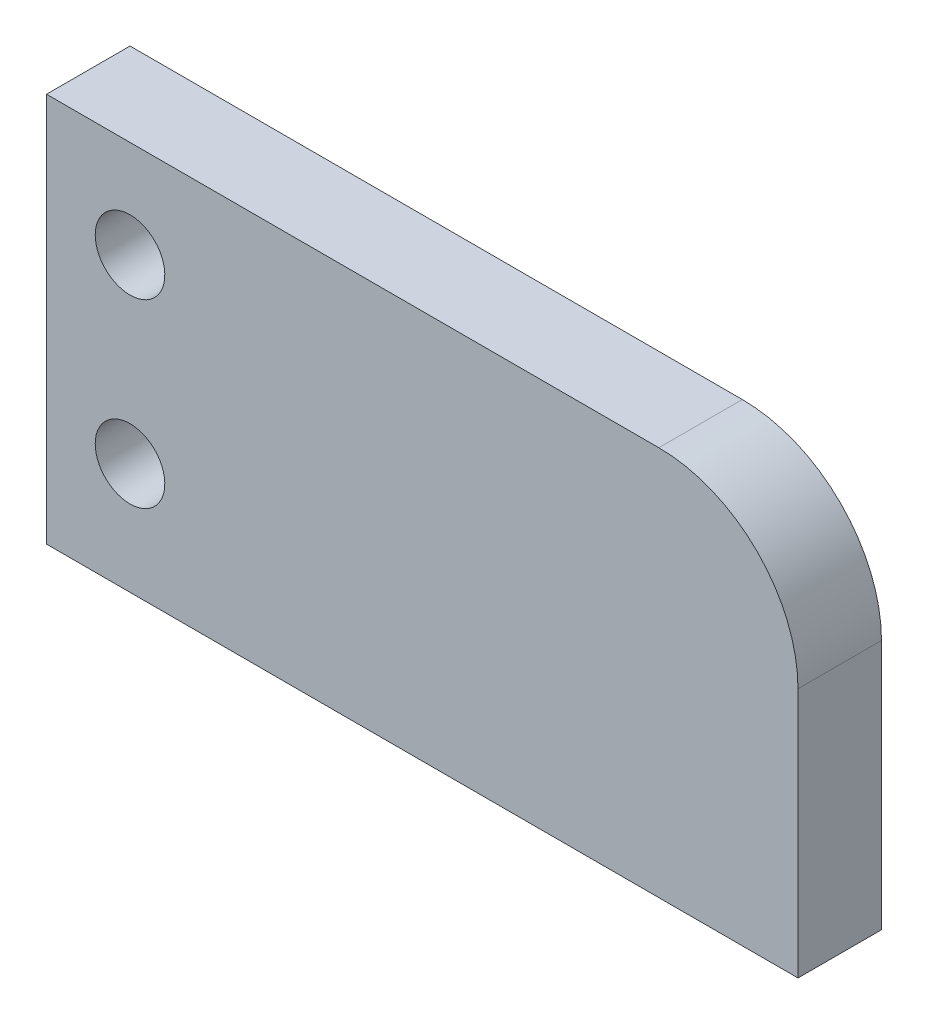
ISO-10303-21;
HEADER;
FILE_DESCRIPTION(('STEP AP214'),'2;1');
FILE_NAME('part.step','',(''),(''),'','','');
FILE_SCHEMA(('AUTOMOTIVE_DESIGN { 1 0 10303 214 1 1 1 1 }'));
ENDSEC;
DATA;
#1=APPLICATION_CONTEXT('core data for automotive mechanical design processes');
#2=APPLICATION_PROTOCOL_DEFINITION('international standard','automotive_design',2000,#1);
#3=PRODUCT_CONTEXT('',#1,'mechanical');
#4=PRODUCT('Part','Part','',(#3));
#5=PRODUCT_RELATED_PRODUCT_CATEGORY('part','',(#4));
#6=PRODUCT_DEFINITION_FORMATION('','',#4);
#7=PRODUCT_DEFINITION_CONTEXT('part definition',#1,'design');
#8=PRODUCT_DEFINITION('design','',#6,#7);
#9=PRODUCT_DEFINITION_SHAPE('','',#8);
#10=(LENGTH_UNIT() NAMED_UNIT(*) SI_UNIT(.MILLI.,.METRE.));
#11=(NAMED_UNIT(*) PLANE_ANGLE_UNIT() SI_UNIT($,.RADIAN.));
#12=(NAMED_UNIT(*) SI_UNIT($,.STERADIAN.) SOLID_ANGLE_UNIT());
#13=UNCERTAINTY_MEASURE_WITH_UNIT(LENGTH_MEASURE(1.E-05),#10,'distance_accuracy_value','');
#14=(GEOMETRIC_REPRESENTATION_CONTEXT(3) GLOBAL_UNCERTAINTY_ASSIGNED_CONTEXT((#13)) GLOBAL_UNIT_ASSIGNED_CONTEXT((#10,
#11,#12)) REPRESENTATION_CONTEXT('',''));
#15=CARTESIAN_POINT('',(0.,0.,0.));
#16=DIRECTION('',(0.,0.,1.));
#17=DIRECTION('',(1.,0.,0.));
#18=AXIS2_PLACEMENT_3D('',#15,#16,#17);
#19=CARTESIAN_POINT('',(-50.,67.,0.));
#20=DIRECTION('',(0.,1.,0.));
#21=DIRECTION('',(0.,0.,1.));
#22=AXIS2_PLACEMENT_3D('',#19,#20,#21);
#23=PLANE('',#22);
#24=DIRECTION('',(1.,0.,0.));
#25=VECTOR('',#24,1.);
#26=CARTESIAN_POINT('',(-50.,67.,5.));
#27=LINE('',#26,#25);
#28=CARTESIAN_POINT('',(-17.,67.,5.));
#29=VERTEX_POINT('',#28);
#30=CARTESIAN_POINT('',(5.,67.,5.));
#31=VERTEX_POINT('',#30);
#32=EDGE_CURVE('E154',#29,#31,#27,.T.);
#33=ORIENTED_EDGE('',*,*,#32,.T.);
#34=DIRECTION('',(0.,0.,1.));
#35=VECTOR('',#34,1.);
#36=CARTESIAN_POINT('',(5.,67.,2.));
#37=LINE('',#36,#35);
#38=CARTESIAN_POINT('',(5.,67.,2.));
#39=VERTEX_POINT('',#38);
#40=EDGE_CURVE('E96',#31,#39,#37,.F.);
#41=ORIENTED_EDGE('',*,*,#40,.T.);
#42=DIRECTION('',(1.,0.,0.));
#43=VECTOR('',#42,1.);
#44=CARTESIAN_POINT('',(-17.,67.,2.));
#45=LINE('',#44,#43);
#46=CARTESIAN_POINT('',(-17.,67.,2.));
#47=VERTEX_POINT('',#46);
#48=EDGE_CURVE('E162',#47,#39,#45,.T.);
#49=ORIENTED_EDGE('',*,*,#48,.F.);
#50=DIRECTION('',(0.,0.,-1.));
#51=VECTOR('',#50,1.);
#52=CARTESIAN_POINT('',(-17.,67.,54.));
#53=LINE('',#52,#51);
#54=EDGE_CURVE('E178',#29,#47,#53,.T.);
#55=ORIENTED_EDGE('',*,*,#54,.F.);
#56=EDGE_LOOP('',(#33,#41,#49,#55));
#57=FACE_BOUND('',#56,.T.);
#58=ADVANCED_FACE('F87',(#57),#23,.T.);
#59=CARTESIAN_POINT('',(-17.,0.,54.));
#60=DIRECTION('',(-1.,0.,0.));
#61=DIRECTION('',(0.,0.,1.));
#62=AXIS2_PLACEMENT_3D('',#59,#60,#61);
#63=PLANE('',#62);
#64=ORIENTED_EDGE('',*,*,#54,.T.);
#65=DIRECTION('',(0.,1.,0.));
#66=VECTOR('',#65,1.);
#67=CARTESIAN_POINT('',(-17.,53.,2.));
#68=LINE('',#67,#66);
#69=CARTESIAN_POINT('',(-17.,53.,2.));
#70=VERTEX_POINT('',#69);
#71=EDGE_CURVE('E169',#70,#47,#68,.T.);
#72=ORIENTED_EDGE('',*,*,#71,.F.);
#73=DIRECTION('',(0.,0.,-1.));
#74=VECTOR('',#73,1.);
#75=CARTESIAN_POINT('',(-17.,53.,54.));
#76=LINE('',#75,#74);
#77=CARTESIAN_POINT('',(-17.,53.,5.));
#78=VERTEX_POINT('',#77);
#79=EDGE_CURVE('E177',#78,#70,#76,.T.);
#80=ORIENTED_EDGE('',*,*,#79,.F.);
#81=DIRECTION('',(0.,-1.,0.));
#82=VECTOR('',#81,1.);
#83=CARTESIAN_POINT('',(-17.,67.,5.));
#84=LINE('',#83,#82);
#85=EDGE_CURVE('E149',#29,#78,#84,.T.);
#86=ORIENTED_EDGE('',*,*,#85,.F.);
#87=EDGE_LOOP('',(#64,#72,#80,#86));
#88=FACE_BOUND('',#87,.T.);
#89=ADVANCED_FACE('F223',(#88),#63,.T.);
#90=CARTESIAN_POINT('',(0.,53.,54.));
#91=DIRECTION('',(0.,-1.,0.));
#92=DIRECTION('',(0.,0.,-1.));
#93=AXIS2_PLACEMENT_3D('',#90,#91,#92);
#94=PLANE('',#93);
#95=ORIENTED_EDGE('',*,*,#79,.T.);
#96=DIRECTION('',(-1.,0.,0.));
#97=VECTOR('',#96,1.);
#98=CARTESIAN_POINT('',(0.,53.,2.));
#99=LINE('',#98,#97);
#100=CARTESIAN_POINT('',(10.,53.,2.));
#101=VERTEX_POINT('',#100);
#102=EDGE_CURVE('E157',#101,#70,#99,.T.);
#103=ORIENTED_EDGE('',*,*,#102,.F.);
#104=DIRECTION('',(0.,0.,-1.));
#105=VECTOR('',#104,1.);
#106=CARTESIAN_POINT('',(10.,53.,2.));
#107=LINE('',#106,#105);
#108=CARTESIAN_POINT('',(10.,53.,5.));
#109=VERTEX_POINT('',#108);
#110=EDGE_CURVE('E140',#109,#101,#107,.T.);
#111=ORIENTED_EDGE('',*,*,#110,.F.);
#112=DIRECTION('',(1.,0.,0.));
#113=VECTOR('',#112,1.);
#114=CARTESIAN_POINT('',(-50.,53.,5.));
#115=LINE('',#114,#113);
#116=EDGE_CURVE('E147',#78,#109,#115,.T.);
#117=ORIENTED_EDGE('',*,*,#116,.F.);
#118=EDGE_LOOP('',(#95,#103,#111,#117));
#119=FACE_BOUND('',#118,.T.);
#120=ADVANCED_FACE('F156',(#119),#94,.T.);
#121=CARTESIAN_POINT('',(-14.,63.5,54.));
#122=DIRECTION('',(0.,0.,-1.));
#123=DIRECTION('',(-1.,0.,0.));
#124=AXIS2_PLACEMENT_3D('',#121,#122,#123);
#125=CYLINDRICAL_SURFACE('',#124,1.25);
#126=CARTESIAN_POINT('',(-14.,63.5,5.));
#127=DIRECTION('',(0.,0.,1.));
#128=DIRECTION('',(0.,-1.,0.));
#129=AXIS2_PLACEMENT_3D('',#126,#127,#128);
#130=CIRCLE('',#129,1.25);
#131=CARTESIAN_POINT('',(-14.,62.25,5.));
#132=VERTEX_POINT('',#131);
#133=EDGE_CURVE('E186',#132,#132,#130,.T.);
#134=ORIENTED_EDGE('',*,*,#133,.T.);
#135=EDGE_LOOP('',(#134));
#136=FACE_BOUND('',#135,.T.);
#137=CARTESIAN_POINT('',(-14.,63.5,2.));
#138=DIRECTION('',(0.,0.,-1.));
#139=DIRECTION('',(-1.,0.,0.));
#140=AXIS2_PLACEMENT_3D('',#137,#138,#139);
#141=CIRCLE('',#140,1.25);
#142=CARTESIAN_POINT('',(-15.25,63.5,2.));
#143=VERTEX_POINT('',#142);
#144=EDGE_CURVE('E173',#143,#143,#141,.F.);
#145=ORIENTED_EDGE('',*,*,#144,.F.);
#146=EDGE_LOOP('',(#145));
#147=FACE_BOUND('',#146,.T.);
#148=ADVANCED_FACE('F210',(#136,#147),#125,.F.);
#149=CARTESIAN_POINT('',(-14.,57.,54.));
#150=DIRECTION('',(0.,0.,-1.));
#151=DIRECTION('',(-1.,0.,0.));
#152=AXIS2_PLACEMENT_3D('',#149,#150,#151);
#153=CYLINDRICAL_SURFACE('',#152,1.25);
#154=CARTESIAN_POINT('',(-14.,57.,5.));
#155=DIRECTION('',(0.,0.,1.));
#156=DIRECTION('',(0.,-1.,0.));
#157=AXIS2_PLACEMENT_3D('',#154,#155,#156);
#158=CIRCLE('',#157,1.25);
#159=CARTESIAN_POINT('',(-14.,55.75,5.));
#160=VERTEX_POINT('',#159);
#161=EDGE_CURVE('E188',#160,#160,#158,.T.);
#162=ORIENTED_EDGE('',*,*,#161,.T.);
#163=EDGE_LOOP('',(#162));
#164=FACE_BOUND('',#163,.T.);
#165=CARTESIAN_POINT('',(-14.,57.,2.));
#166=DIRECTION('',(0.,0.,-1.));
#167=DIRECTION('',(-1.,0.,0.));
#168=AXIS2_PLACEMENT_3D('',#165,#166,#167);
#169=CIRCLE('',#168,1.25);
#170=CARTESIAN_POINT('',(-15.25,57.,2.));
#171=VERTEX_POINT('',#170);
#172=EDGE_CURVE('E172',#171,#171,#169,.F.);
#173=ORIENTED_EDGE('',*,*,#172,.F.);
#174=EDGE_LOOP('',(#173));
#175=FACE_BOUND('',#174,.T.);
#176=ADVANCED_FACE('F208',(#164,#175),#153,.F.);
#177=CARTESIAN_POINT('',(-50.,67.,5.));
#178=DIRECTION('',(0.,0.,1.));
#179=DIRECTION('',(0.,-1.,0.));
#180=AXIS2_PLACEMENT_3D('',#177,#178,#179);
#181=PLANE('',#180);
#182=ORIENTED_EDGE('',*,*,#161,.F.);
#183=EDGE_LOOP('',(#182));
#184=FACE_BOUND('',#183,.T.);
#185=ORIENTED_EDGE('',*,*,#133,.F.);
#186=EDGE_LOOP('',(#185));
#187=FACE_BOUND('',#186,.T.);
#188=DIRECTION('',(0.,-1.,0.));
#189=VECTOR('',#188,1.);
#190=CARTESIAN_POINT('',(10.,53.,5.));
#191=LINE('',#190,#189);
#192=CARTESIAN_POINT('',(10.,62.,5.));
#193=VERTEX_POINT('',#192);
#194=EDGE_CURVE('E135',#193,#109,#191,.T.);
#195=ORIENTED_EDGE('',*,*,#194,.F.);
#196=CARTESIAN_POINT('',(5.,62.,5.));
#197=DIRECTION('',(0.,0.,1.));
#198=DIRECTION('',(0.,-1.,0.));
#199=AXIS2_PLACEMENT_3D('',#196,#197,#198);
#200=CIRCLE('',#199,5.);
#201=EDGE_CURVE('E110',#193,#31,#200,.T.);
#202=ORIENTED_EDGE('',*,*,#201,.T.);
#203=ORIENTED_EDGE('',*,*,#32,.F.);
#204=ORIENTED_EDGE('',*,*,#85,.T.);
#205=ORIENTED_EDGE('',*,*,#116,.T.);
#206=EDGE_LOOP('',(#195,#202,#203,#204,#205));
#207=FACE_BOUND('',#206,.T.);
#208=ADVANCED_FACE('F148',(#184,#187,#207),#181,.T.);
#209=CARTESIAN_POINT('',(0.,0.,2.));
#210=DIRECTION('',(0.,0.,-1.));
#211=DIRECTION('',(-1.,0.,0.));
#212=AXIS2_PLACEMENT_3D('',#209,#210,#211);
#213=PLANE('',#212);
#214=ORIENTED_EDGE('',*,*,#48,.T.);
#215=CARTESIAN_POINT('',(5.,62.,2.));
#216=DIRECTION('',(0.,0.,-1.));
#217=DIRECTION('',(-1.,0.,0.));
#218=AXIS2_PLACEMENT_3D('',#215,#216,#217);
#219=CIRCLE('',#218,5.);
#220=CARTESIAN_POINT('',(10.,62.,2.));
#221=VERTEX_POINT('',#220);
#222=EDGE_CURVE('E12',#39,#221,#219,.T.);
#223=ORIENTED_EDGE('',*,*,#222,.T.);
#224=DIRECTION('',(0.,1.,0.));
#225=VECTOR('',#224,1.);
#226=CARTESIAN_POINT('',(10.,67.,2.));
#227=LINE('',#226,#225);
#228=EDGE_CURVE('E159',#101,#221,#227,.T.);
#229=ORIENTED_EDGE('',*,*,#228,.F.);
#230=ORIENTED_EDGE('',*,*,#102,.T.);
#231=ORIENTED_EDGE('',*,*,#71,.T.);
#232=EDGE_LOOP('',(#214,#223,#229,#230,#231));
#233=FACE_BOUND('',#232,.T.);
#234=ORIENTED_EDGE('',*,*,#172,.T.);
#235=EDGE_LOOP('',(#234));
#236=FACE_BOUND('',#235,.T.);
#237=ORIENTED_EDGE('',*,*,#144,.T.);
#238=EDGE_LOOP('',(#237));
#239=FACE_BOUND('',#238,.T.);
#240=ADVANCED_FACE('F205',(#233,#236,#239),#213,.T.);
#241=CARTESIAN_POINT('',(10.,0.,0.));
#242=DIRECTION('',(-1.,0.,0.));
#243=DIRECTION('',(0.,0.,1.));
#244=AXIS2_PLACEMENT_3D('',#241,#242,#243);
#245=PLANE('',#244);
#246=ORIENTED_EDGE('',*,*,#228,.T.);
#247=DIRECTION('',(0.,0.,1.));
#248=VECTOR('',#247,1.);
#249=CARTESIAN_POINT('',(10.,62.,5.));
#250=LINE('',#249,#248);
#251=EDGE_CURVE('E143',#221,#193,#250,.T.);
#252=ORIENTED_EDGE('',*,*,#251,.T.);
#253=ORIENTED_EDGE('',*,*,#194,.T.);
#254=ORIENTED_EDGE('',*,*,#110,.T.);
#255=EDGE_LOOP('',(#246,#252,#253,#254));
#256=FACE_BOUND('',#255,.T.);
#257=ADVANCED_FACE('F138',(#256),#245,.F.);
#258=CARTESIAN_POINT('',(5.,62.,0.));
#259=DIRECTION('',(0.,0.,-1.));
#260=DIRECTION('',(-1.,0.,0.));
#261=AXIS2_PLACEMENT_3D('',#258,#259,#260);
#262=CYLINDRICAL_SURFACE('',#261,5.);
#263=ORIENTED_EDGE('',*,*,#222,.F.);
#264=ORIENTED_EDGE('',*,*,#40,.F.);
#265=ORIENTED_EDGE('',*,*,#201,.F.);
#266=ORIENTED_EDGE('',*,*,#251,.F.);
#267=EDGE_LOOP('',(#263,#264,#265,#266));
#268=FACE_BOUND('',#267,.T.);
#269=ADVANCED_FACE('F89',(#268),#262,.T.);
#270=CLOSED_SHELL('',(#58,#89,#120,#148,#176,#208,#240,#257,#269));
#271=MANIFOLD_SOLID_BREP('B2',#270);
#272=ADVANCED_BREP_SHAPE_REPRESENTATION('',(#18,#271),#14);
#273=SHAPE_DEFINITION_REPRESENTATION(#9,#272);
ENDSEC;
END-ISO-10303-21;
